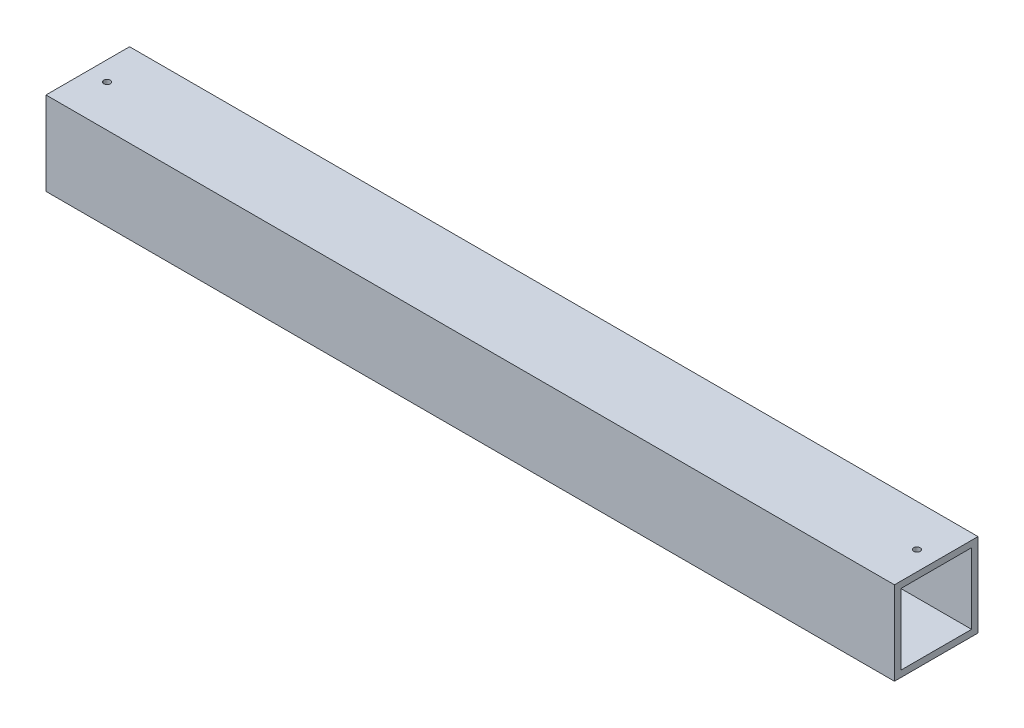
ISO-10303-21;
HEADER;
FILE_DESCRIPTION(('STEP AP214'),'2;1');
FILE_NAME('part.step','',(''),(''),'','','');
FILE_SCHEMA(('AUTOMOTIVE_DESIGN { 1 0 10303 214 1 1 1 1 }'));
ENDSEC;
DATA;
#1=APPLICATION_CONTEXT('core data for automotive mechanical design processes');
#2=APPLICATION_PROTOCOL_DEFINITION('international standard','automotive_design',2000,#1);
#3=PRODUCT_CONTEXT('',#1,'mechanical');
#4=PRODUCT('Part','Part','',(#3));
#5=PRODUCT_RELATED_PRODUCT_CATEGORY('part','',(#4));
#6=PRODUCT_DEFINITION_FORMATION('','',#4);
#7=PRODUCT_DEFINITION_CONTEXT('part definition',#1,'design');
#8=PRODUCT_DEFINITION('design','',#6,#7);
#9=PRODUCT_DEFINITION_SHAPE('','',#8);
#10=(LENGTH_UNIT() NAMED_UNIT(*) SI_UNIT(.MILLI.,.METRE.));
#11=(NAMED_UNIT(*) PLANE_ANGLE_UNIT() SI_UNIT($,.RADIAN.));
#12=(NAMED_UNIT(*) SI_UNIT($,.STERADIAN.) SOLID_ANGLE_UNIT());
#13=UNCERTAINTY_MEASURE_WITH_UNIT(LENGTH_MEASURE(1.E-05),#10,'distance_accuracy_value','');
#14=(GEOMETRIC_REPRESENTATION_CONTEXT(3) GLOBAL_UNCERTAINTY_ASSIGNED_CONTEXT((#13)) GLOBAL_UNIT_ASSIGNED_CONTEXT((#10,
#11,#12)) REPRESENTATION_CONTEXT('',''));
#15=CARTESIAN_POINT('',(0.,0.,0.));
#16=DIRECTION('',(0.,0.,1.));
#17=DIRECTION('',(1.,0.,0.));
#18=AXIS2_PLACEMENT_3D('',#15,#16,#17);
#19=CARTESIAN_POINT('',(0.,0.,165.1));
#20=DIRECTION('',(1.,0.,0.));
#21=DIRECTION('',(0.,0.,-1.));
#22=AXIS2_PLACEMENT_3D('',#19,#20,#21);
#23=PLANE('',#22);
#24=DIRECTION('',(0.,0.,-1.));
#25=VECTOR('',#24,1.);
#26=CARTESIAN_POINT('',(0.,152.4,152.4));
#27=LINE('',#26,#25);
#28=CARTESIAN_POINT('',(0.,152.4,152.4));
#29=VERTEX_POINT('',#28);
#30=CARTESIAN_POINT('',(0.,152.4,12.7));
#31=VERTEX_POINT('',#30);
#32=EDGE_CURVE('E222',#29,#31,#27,.T.);
#33=ORIENTED_EDGE('',*,*,#32,.F.);
#34=DIRECTION('',(0.,1.,0.));
#35=VECTOR('',#34,1.);
#36=CARTESIAN_POINT('',(0.,12.7,152.4));
#37=LINE('',#36,#35);
#38=CARTESIAN_POINT('',(0.,12.7,152.4));
#39=VERTEX_POINT('',#38);
#40=EDGE_CURVE('E127',#39,#29,#37,.T.);
#41=ORIENTED_EDGE('',*,*,#40,.F.);
#42=DIRECTION('',(0.,0.,1.));
#43=VECTOR('',#42,1.);
#44=CARTESIAN_POINT('',(0.,12.7,152.4));
#45=LINE('',#44,#43);
#46=CARTESIAN_POINT('',(0.,12.7,12.7));
#47=VERTEX_POINT('',#46);
#48=EDGE_CURVE('E124',#47,#39,#45,.T.);
#49=ORIENTED_EDGE('',*,*,#48,.F.);
#50=DIRECTION('',(0.,-1.,0.));
#51=VECTOR('',#50,1.);
#52=CARTESIAN_POINT('',(0.,12.7,12.7));
#53=LINE('',#52,#51);
#54=EDGE_CURVE('E102',#31,#47,#53,.T.);
#55=ORIENTED_EDGE('',*,*,#54,.F.);
#56=EDGE_LOOP('',(#33,#41,#49,#55));
#57=FACE_BOUND('',#56,.T.);
#58=DIRECTION('',(0.,-1.,0.));
#59=VECTOR('',#58,1.);
#60=CARTESIAN_POINT('',(0.,0.,0.));
#61=LINE('',#60,#59);
#62=CARTESIAN_POINT('',(0.,165.1,0.));
#63=VERTEX_POINT('',#62);
#64=CARTESIAN_POINT('',(0.,0.,0.));
#65=VERTEX_POINT('',#64);
#66=EDGE_CURVE('E126',#63,#65,#61,.T.);
#67=ORIENTED_EDGE('',*,*,#66,.T.);
#68=DIRECTION('',(0.,0.,-1.));
#69=VECTOR('',#68,1.);
#70=CARTESIAN_POINT('',(0.,0.,165.1));
#71=LINE('',#70,#69);
#72=CARTESIAN_POINT('',(0.,0.,165.1));
#73=VERTEX_POINT('',#72);
#74=EDGE_CURVE('E11',#73,#65,#71,.T.);
#75=ORIENTED_EDGE('',*,*,#74,.F.);
#76=DIRECTION('',(0.,-1.,0.));
#77=VECTOR('',#76,1.);
#78=CARTESIAN_POINT('',(0.,0.,165.1));
#79=LINE('',#78,#77);
#80=CARTESIAN_POINT('',(0.,165.1,165.1));
#81=VERTEX_POINT('',#80);
#82=EDGE_CURVE('E128',#81,#73,#79,.T.);
#83=ORIENTED_EDGE('',*,*,#82,.F.);
#84=DIRECTION('',(0.,0.,-1.));
#85=VECTOR('',#84,1.);
#86=CARTESIAN_POINT('',(0.,165.1,165.1));
#87=LINE('',#86,#85);
#88=EDGE_CURVE('E138',#81,#63,#87,.T.);
#89=ORIENTED_EDGE('',*,*,#88,.T.);
#90=EDGE_LOOP('',(#67,#75,#83,#89));
#91=FACE_BOUND('',#90,.T.);
#92=ADVANCED_FACE('F32',(#57,#91),#23,.F.);
#93=CARTESIAN_POINT('',(0.,0.,165.1));
#94=DIRECTION('',(0.,1.,0.));
#95=DIRECTION('',(0.,0.,1.));
#96=AXIS2_PLACEMENT_3D('',#93,#94,#95);
#97=PLANE('',#96);
#98=DIRECTION('',(1.,0.,0.));
#99=VECTOR('',#98,1.);
#100=CARTESIAN_POINT('',(0.,0.,0.));
#101=LINE('',#100,#99);
#102=CARTESIAN_POINT('',(1676.4,0.,0.));
#103=VERTEX_POINT('',#102);
#104=EDGE_CURVE('E141',#65,#103,#101,.T.);
#105=ORIENTED_EDGE('',*,*,#104,.T.);
#106=DIRECTION('',(0.,0.,-1.));
#107=VECTOR('',#106,1.);
#108=CARTESIAN_POINT('',(1676.4,0.,165.1));
#109=LINE('',#108,#107);
#110=CARTESIAN_POINT('',(1676.4,0.,165.1));
#111=VERTEX_POINT('',#110);
#112=EDGE_CURVE('E39',#111,#103,#109,.T.);
#113=ORIENTED_EDGE('',*,*,#112,.F.);
#114=DIRECTION('',(1.,0.,0.));
#115=VECTOR('',#114,1.);
#116=CARTESIAN_POINT('',(0.,0.,165.1));
#117=LINE('',#116,#115);
#118=EDGE_CURVE('E131',#73,#111,#117,.T.);
#119=ORIENTED_EDGE('',*,*,#118,.F.);
#120=ORIENTED_EDGE('',*,*,#74,.T.);
#121=EDGE_LOOP('',(#105,#113,#119,#120));
#122=FACE_BOUND('',#121,.T.);
#123=ADVANCED_FACE('F169',(#122),#97,.F.);
#124=CARTESIAN_POINT('',(1676.4,0.,165.1));
#125=DIRECTION('',(-1.,0.,0.));
#126=DIRECTION('',(0.,0.,1.));
#127=AXIS2_PLACEMENT_3D('',#124,#125,#126);
#128=PLANE('',#127);
#129=DIRECTION('',(0.,0.,-1.));
#130=VECTOR('',#129,1.);
#131=CARTESIAN_POINT('',(1676.4,12.7,152.4));
#132=LINE('',#131,#130);
#133=CARTESIAN_POINT('',(1676.4,12.7,152.4));
#134=VERTEX_POINT('',#133);
#135=CARTESIAN_POINT('',(1676.4,12.7,12.7));
#136=VERTEX_POINT('',#135);
#137=EDGE_CURVE('E108',#134,#136,#132,.T.);
#138=ORIENTED_EDGE('',*,*,#137,.F.);
#139=DIRECTION('',(0.,-1.,0.));
#140=VECTOR('',#139,1.);
#141=CARTESIAN_POINT('',(1676.4,12.7,152.4));
#142=LINE('',#141,#140);
#143=CARTESIAN_POINT('',(1676.4,152.4,152.4));
#144=VERTEX_POINT('',#143);
#145=EDGE_CURVE('E54',#144,#134,#142,.T.);
#146=ORIENTED_EDGE('',*,*,#145,.F.);
#147=DIRECTION('',(0.,0.,1.));
#148=VECTOR('',#147,1.);
#149=CARTESIAN_POINT('',(1676.4,152.4,152.4));
#150=LINE('',#149,#148);
#151=CARTESIAN_POINT('',(1676.4,152.4,12.7));
#152=VERTEX_POINT('',#151);
#153=EDGE_CURVE('E115',#152,#144,#150,.T.);
#154=ORIENTED_EDGE('',*,*,#153,.F.);
#155=DIRECTION('',(0.,1.,0.));
#156=VECTOR('',#155,1.);
#157=CARTESIAN_POINT('',(1676.4,12.7,12.7));
#158=LINE('',#157,#156);
#159=EDGE_CURVE('E99',#136,#152,#158,.T.);
#160=ORIENTED_EDGE('',*,*,#159,.F.);
#161=EDGE_LOOP('',(#138,#146,#154,#160));
#162=FACE_BOUND('',#161,.T.);
#163=DIRECTION('',(0.,1.,0.));
#164=VECTOR('',#163,1.);
#165=CARTESIAN_POINT('',(1676.4,0.,0.));
#166=LINE('',#165,#164);
#167=CARTESIAN_POINT('',(1676.4,165.1,0.));
#168=VERTEX_POINT('',#167);
#169=EDGE_CURVE('E143',#103,#168,#166,.T.);
#170=ORIENTED_EDGE('',*,*,#169,.T.);
#171=DIRECTION('',(0.,0.,-1.));
#172=VECTOR('',#171,1.);
#173=CARTESIAN_POINT('',(1676.4,165.1,165.1));
#174=LINE('',#173,#172);
#175=CARTESIAN_POINT('',(1676.4,165.1,165.1));
#176=VERTEX_POINT('',#175);
#177=EDGE_CURVE('E148',#176,#168,#174,.T.);
#178=ORIENTED_EDGE('',*,*,#177,.F.);
#179=DIRECTION('',(0.,1.,0.));
#180=VECTOR('',#179,1.);
#181=CARTESIAN_POINT('',(1676.4,0.,165.1));
#182=LINE('',#181,#180);
#183=EDGE_CURVE('E134',#111,#176,#182,.T.);
#184=ORIENTED_EDGE('',*,*,#183,.F.);
#185=ORIENTED_EDGE('',*,*,#112,.T.);
#186=EDGE_LOOP('',(#170,#178,#184,#185));
#187=FACE_BOUND('',#186,.T.);
#188=ADVANCED_FACE('F112',(#162,#187),#128,.F.);
#189=CARTESIAN_POINT('',(0.,165.1,165.1));
#190=DIRECTION('',(0.,-1.,0.));
#191=DIRECTION('',(0.,0.,-1.));
#192=AXIS2_PLACEMENT_3D('',#189,#190,#191);
#193=PLANE('',#192);
#194=CARTESIAN_POINT('',(38.1,165.1,82.55));
#195=DIRECTION('',(0.,1.,0.));
#196=DIRECTION('',(0.,0.,1.));
#197=AXIS2_PLACEMENT_3D('',#194,#195,#196);
#198=CIRCLE('',#197,6.34999999999999);
#199=CARTESIAN_POINT('',(38.1,165.1,88.9));
#200=VERTEX_POINT('',#199);
#201=EDGE_CURVE('E211',#200,#200,#198,.T.);
#202=ORIENTED_EDGE('',*,*,#201,.F.);
#203=EDGE_LOOP('',(#202));
#204=FACE_BOUND('',#203,.T.);
#205=CARTESIAN_POINT('',(1638.3,165.1,82.55));
#206=DIRECTION('',(0.,1.,0.));
#207=DIRECTION('',(0.,0.,1.));
#208=AXIS2_PLACEMENT_3D('',#205,#206,#207);
#209=CIRCLE('',#208,6.35000000000016);
#210=CARTESIAN_POINT('',(1638.3,165.1,88.9000000000002));
#211=VERTEX_POINT('',#210);
#212=EDGE_CURVE('E216',#211,#211,#209,.T.);
#213=ORIENTED_EDGE('',*,*,#212,.F.);
#214=EDGE_LOOP('',(#213));
#215=FACE_BOUND('',#214,.T.);
#216=DIRECTION('',(-1.,0.,0.));
#217=VECTOR('',#216,1.);
#218=CARTESIAN_POINT('',(0.,165.1,0.));
#219=LINE('',#218,#217);
#220=EDGE_CURVE('E132',#168,#63,#219,.T.);
#221=ORIENTED_EDGE('',*,*,#220,.T.);
#222=ORIENTED_EDGE('',*,*,#88,.F.);
#223=DIRECTION('',(-1.,0.,0.));
#224=VECTOR('',#223,1.);
#225=CARTESIAN_POINT('',(0.,165.1,165.1));
#226=LINE('',#225,#224);
#227=EDGE_CURVE('E136',#176,#81,#226,.T.);
#228=ORIENTED_EDGE('',*,*,#227,.F.);
#229=ORIENTED_EDGE('',*,*,#177,.T.);
#230=EDGE_LOOP('',(#221,#222,#228,#229));
#231=FACE_BOUND('',#230,.T.);
#232=ADVANCED_FACE('F162',(#204,#215,#231),#193,.F.);
#233=CARTESIAN_POINT('',(0.,0.,165.1));
#234=DIRECTION('',(0.,0.,-1.));
#235=DIRECTION('',(-1.,0.,0.));
#236=AXIS2_PLACEMENT_3D('',#233,#234,#235);
#237=PLANE('',#236);
#238=ORIENTED_EDGE('',*,*,#82,.T.);
#239=ORIENTED_EDGE('',*,*,#118,.T.);
#240=ORIENTED_EDGE('',*,*,#183,.T.);
#241=ORIENTED_EDGE('',*,*,#227,.T.);
#242=EDGE_LOOP('',(#238,#239,#240,#241));
#243=FACE_BOUND('',#242,.T.);
#244=ADVANCED_FACE('F168',(#243),#237,.F.);
#245=CARTESIAN_POINT('',(0.,0.,0.));
#246=DIRECTION('',(0.,0.,-1.));
#247=DIRECTION('',(-1.,0.,0.));
#248=AXIS2_PLACEMENT_3D('',#245,#246,#247);
#249=PLANE('',#248);
#250=ORIENTED_EDGE('',*,*,#66,.F.);
#251=ORIENTED_EDGE('',*,*,#220,.F.);
#252=ORIENTED_EDGE('',*,*,#169,.F.);
#253=ORIENTED_EDGE('',*,*,#104,.F.);
#254=EDGE_LOOP('',(#250,#251,#252,#253));
#255=FACE_BOUND('',#254,.T.);
#256=ADVANCED_FACE('F159',(#255),#249,.T.);
#257=CARTESIAN_POINT('',(-197.565634663521,12.7,152.4));
#258=DIRECTION('',(0.,0.,1.));
#259=DIRECTION('',(1.,0.,0.));
#260=AXIS2_PLACEMENT_3D('',#257,#258,#259);
#261=PLANE('',#260);
#262=ORIENTED_EDGE('',*,*,#40,.T.);
#263=DIRECTION('',(1.,0.,0.));
#264=VECTOR('',#263,1.);
#265=CARTESIAN_POINT('',(-197.565634663521,152.4,152.4));
#266=LINE('',#265,#264);
#267=EDGE_CURVE('E120',#29,#144,#266,.T.);
#268=ORIENTED_EDGE('',*,*,#267,.T.);
#269=ORIENTED_EDGE('',*,*,#145,.T.);
#270=DIRECTION('',(1.,0.,0.));
#271=VECTOR('',#270,1.);
#272=CARTESIAN_POINT('',(-197.565634663521,12.7,152.4));
#273=LINE('',#272,#271);
#274=EDGE_CURVE('E105',#39,#134,#273,.T.);
#275=ORIENTED_EDGE('',*,*,#274,.F.);
#276=EDGE_LOOP('',(#262,#268,#269,#275));
#277=FACE_BOUND('',#276,.T.);
#278=ADVANCED_FACE('F183',(#277),#261,.F.);
#279=CARTESIAN_POINT('',(-197.565634663521,152.4,152.4));
#280=DIRECTION('',(0.,1.,0.));
#281=DIRECTION('',(0.,0.,1.));
#282=AXIS2_PLACEMENT_3D('',#279,#280,#281);
#283=PLANE('',#282);
#284=CARTESIAN_POINT('',(38.1,152.4,82.55));
#285=DIRECTION('',(0.,1.,0.));
#286=DIRECTION('',(0.,0.,1.));
#287=AXIS2_PLACEMENT_3D('',#284,#285,#286);
#288=CIRCLE('',#287,6.34999999999999);
#289=CARTESIAN_POINT('',(38.1,152.4,88.9));
#290=VERTEX_POINT('',#289);
#291=EDGE_CURVE('E208',#290,#290,#288,.F.);
#292=ORIENTED_EDGE('',*,*,#291,.F.);
#293=EDGE_LOOP('',(#292));
#294=FACE_BOUND('',#293,.T.);
#295=CARTESIAN_POINT('',(1638.3,152.4,82.55));
#296=DIRECTION('',(0.,1.,0.));
#297=DIRECTION('',(0.,0.,1.));
#298=AXIS2_PLACEMENT_3D('',#295,#296,#297);
#299=CIRCLE('',#298,6.35000000000016);
#300=CARTESIAN_POINT('',(1638.3,152.4,88.9000000000002));
#301=VERTEX_POINT('',#300);
#302=EDGE_CURVE('E212',#301,#301,#299,.F.);
#303=ORIENTED_EDGE('',*,*,#302,.F.);
#304=EDGE_LOOP('',(#303));
#305=FACE_BOUND('',#304,.T.);
#306=ORIENTED_EDGE('',*,*,#32,.T.);
#307=DIRECTION('',(1.,0.,0.));
#308=VECTOR('',#307,1.);
#309=CARTESIAN_POINT('',(-197.565634663521,152.4,12.7));
#310=LINE('',#309,#308);
#311=EDGE_CURVE('E104',#31,#152,#310,.T.);
#312=ORIENTED_EDGE('',*,*,#311,.T.);
#313=ORIENTED_EDGE('',*,*,#153,.T.);
#314=ORIENTED_EDGE('',*,*,#267,.F.);
#315=EDGE_LOOP('',(#306,#312,#313,#314));
#316=FACE_BOUND('',#315,.T.);
#317=ADVANCED_FACE('F188',(#294,#305,#316),#283,.F.);
#318=CARTESIAN_POINT('',(-197.565634663521,12.7,12.7));
#319=DIRECTION('',(0.,0.,-1.));
#320=DIRECTION('',(0.,1.,0.));
#321=AXIS2_PLACEMENT_3D('',#318,#319,#320);
#322=PLANE('',#321);
#323=ORIENTED_EDGE('',*,*,#54,.T.);
#324=DIRECTION('',(1.,0.,0.));
#325=VECTOR('',#324,1.);
#326=CARTESIAN_POINT('',(-197.565634663521,12.7,12.7));
#327=LINE('',#326,#325);
#328=EDGE_CURVE('E46',#47,#136,#327,.T.);
#329=ORIENTED_EDGE('',*,*,#328,.T.);
#330=ORIENTED_EDGE('',*,*,#159,.T.);
#331=ORIENTED_EDGE('',*,*,#311,.F.);
#332=EDGE_LOOP('',(#323,#329,#330,#331));
#333=FACE_BOUND('',#332,.T.);
#334=ADVANCED_FACE('F96',(#333),#322,.F.);
#335=CARTESIAN_POINT('',(-197.565634663521,12.7,152.4));
#336=DIRECTION('',(0.,-1.,0.));
#337=DIRECTION('',(0.,0.,-1.));
#338=AXIS2_PLACEMENT_3D('',#335,#336,#337);
#339=PLANE('',#338);
#340=ORIENTED_EDGE('',*,*,#48,.T.);
#341=ORIENTED_EDGE('',*,*,#274,.T.);
#342=ORIENTED_EDGE('',*,*,#137,.T.);
#343=ORIENTED_EDGE('',*,*,#328,.F.);
#344=EDGE_LOOP('',(#340,#341,#342,#343));
#345=FACE_BOUND('',#344,.T.);
#346=ADVANCED_FACE('F109',(#345),#339,.F.);
#347=CARTESIAN_POINT('',(1638.3,134.439487757861,82.55));
#348=DIRECTION('',(0.,1.,0.));
#349=DIRECTION('',(0.,0.,1.));
#350=AXIS2_PLACEMENT_3D('',#347,#348,#349);
#351=CYLINDRICAL_SURFACE('',#350,6.35000000000016);
#352=ORIENTED_EDGE('',*,*,#302,.T.);
#353=EDGE_LOOP('',(#352));
#354=FACE_BOUND('',#353,.T.);
#355=ORIENTED_EDGE('',*,*,#212,.T.);
#356=EDGE_LOOP('',(#355));
#357=FACE_BOUND('',#356,.T.);
#358=ADVANCED_FACE('F191',(#354,#357),#351,.F.);
#359=CARTESIAN_POINT('',(38.1,134.439487757861,82.55));
#360=DIRECTION('',(0.,1.,0.));
#361=DIRECTION('',(0.,0.,1.));
#362=AXIS2_PLACEMENT_3D('',#359,#360,#361);
#363=CYLINDRICAL_SURFACE('',#362,6.34999999999999);
#364=ORIENTED_EDGE('',*,*,#291,.T.);
#365=EDGE_LOOP('',(#364));
#366=FACE_BOUND('',#365,.T.);
#367=ORIENTED_EDGE('',*,*,#201,.T.);
#368=EDGE_LOOP('',(#367));
#369=FACE_BOUND('',#368,.T.);
#370=ADVANCED_FACE('F199',(#366,#369),#363,.F.);
#371=CLOSED_SHELL('',(#92,#123,#188,#232,#244,#256,#278,#317,#334,#346,#358,#370));
#372=MANIFOLD_SOLID_BREP('B2',#371);
#373=ADVANCED_BREP_SHAPE_REPRESENTATION('',(#18,#372),#14);
#374=SHAPE_DEFINITION_REPRESENTATION(#9,#373);
ENDSEC;
END-ISO-10303-21;
